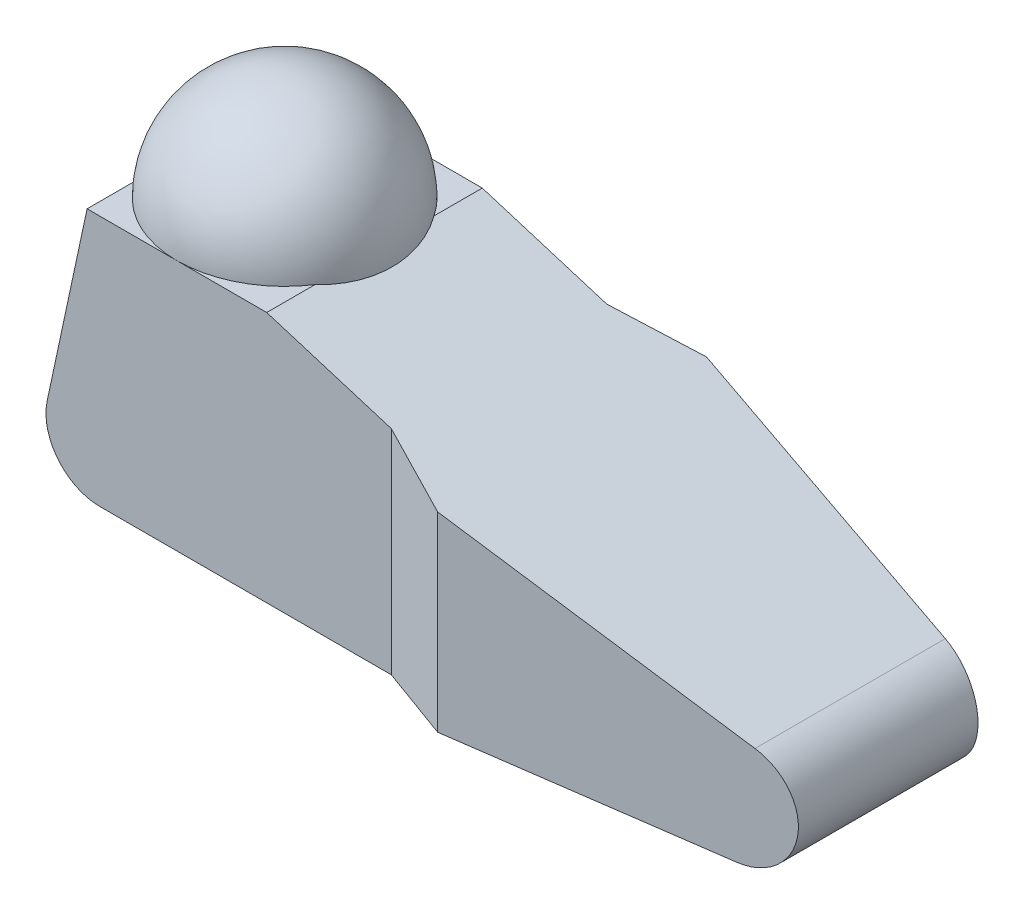
ISO-10303-21;
HEADER;
FILE_DESCRIPTION(('STEP AP214'),'2;1');
FILE_NAME('part.step','',(''),(''),'','','');
FILE_SCHEMA(('AUTOMOTIVE_DESIGN { 1 0 10303 214 1 1 1 1 }'));
ENDSEC;
DATA;
#1=APPLICATION_CONTEXT('core data for automotive mechanical design processes');
#2=APPLICATION_PROTOCOL_DEFINITION('international standard','automotive_design',2000,#1);
#3=PRODUCT_CONTEXT('',#1,'mechanical');
#4=PRODUCT('Part','Part','',(#3));
#5=PRODUCT_RELATED_PRODUCT_CATEGORY('part','',(#4));
#6=PRODUCT_DEFINITION_FORMATION('','',#4);
#7=PRODUCT_DEFINITION_CONTEXT('part definition',#1,'design');
#8=PRODUCT_DEFINITION('design','',#6,#7);
#9=PRODUCT_DEFINITION_SHAPE('','',#8);
#10=(LENGTH_UNIT() NAMED_UNIT(*) SI_UNIT(.MILLI.,.METRE.));
#11=(NAMED_UNIT(*) PLANE_ANGLE_UNIT() SI_UNIT($,.RADIAN.));
#12=(NAMED_UNIT(*) SI_UNIT($,.STERADIAN.) SOLID_ANGLE_UNIT());
#13=UNCERTAINTY_MEASURE_WITH_UNIT(LENGTH_MEASURE(1.E-05),#10,'distance_accuracy_value','');
#14=(GEOMETRIC_REPRESENTATION_CONTEXT(3) GLOBAL_UNCERTAINTY_ASSIGNED_CONTEXT((#13)) GLOBAL_UNIT_ASSIGNED_CONTEXT((#10,
#11,#12)) REPRESENTATION_CONTEXT('',''));
#15=CARTESIAN_POINT('',(0.,0.,0.));
#16=DIRECTION('',(0.,0.,1.));
#17=DIRECTION('',(1.,0.,0.));
#18=AXIS2_PLACEMENT_3D('',#15,#16,#17);
#19=CARTESIAN_POINT('',(31.75,88.9,47.498));
#20=DIRECTION('',(-0.293567286568064,-0.955938412376584,0.));
#21=DIRECTION('',(0.955938412376584,-0.293567286568064,0.));
#22=AXIS2_PLACEMENT_3D('',#19,#20,#21);
#23=PLANE('',#22);
#24=CARTESIAN_POINT('',(2.7362706178382,97.8100738056607,0.));
#25=DIRECTION('',(-0.293567286568064,-0.955938412376584,0.));
#26=DIRECTION('',(0.955938412376584,-0.293567286568064,0.));
#27=AXIS2_PLACEMENT_3D('',#24,#25,#26);
#28=CIRCLE('',#27,36.9422983568109);
#29=CARTESIAN_POINT('',(31.75,88.9,21.0605674187568));
#30=VERTEX_POINT('',#29);
#31=CARTESIAN_POINT('',(31.75,88.9,-21.0605674187568));
#32=VERTEX_POINT('',#31);
#33=EDGE_CURVE('E38',#30,#32,#28,.F.);
#34=ORIENTED_EDGE('',*,*,#33,.F.);
#35=DIRECTION('',(0.,0.,-1.));
#36=VECTOR('',#35,1.);
#37=CARTESIAN_POINT('',(31.75,88.9,47.498));
#38=LINE('',#37,#36);
#39=CARTESIAN_POINT('',(31.75,88.9,38.1));
#40=VERTEX_POINT('',#39);
#41=EDGE_CURVE('E196',#40,#30,#38,.T.);
#42=ORIENTED_EDGE('',*,*,#41,.F.);
#43=DIRECTION('',(-0.955938412376584,0.293567286568064,0.));
#44=VECTOR('',#43,1.);
#45=CARTESIAN_POINT('',(31.75,88.9,38.1));
#46=LINE('',#45,#44);
#47=CARTESIAN_POINT('',(75.7792072119656,75.3786949414186,38.1));
#48=VERTEX_POINT('',#47);
#49=EDGE_CURVE('E181',#48,#40,#46,.T.);
#50=ORIENTED_EDGE('',*,*,#49,.F.);
#51=DIRECTION('',(-0.90285077749815,0.277264151638239,-0.328610808993426));
#52=VECTOR('',#51,1.);
#53=CARTESIAN_POINT('',(39.2927567055439,86.5836304613134,24.8200180616355));
#54=LINE('',#53,#52);
#55=CARTESIAN_POINT('',(101.6,67.4491672880897,47.498));
#56=VERTEX_POINT('',#55);
#57=EDGE_CURVE('E177',#56,#48,#54,.T.);
#58=ORIENTED_EDGE('',*,*,#57,.F.);
#59=DIRECTION('',(-0.947382301327854,0.290939717394537,0.13349477882347));
#60=VECTOR('',#59,1.);
#61=CARTESIAN_POINT('',(32.9947867897229,88.5177277997373,57.1650982250845));
#62=LINE('',#61,#60);
#63=CARTESIAN_POINT('',(199.902456809122,37.260626755774,33.6462901768965));
#64=VERTEX_POINT('',#63);
#65=EDGE_CURVE('E173',#64,#56,#62,.T.);
#66=ORIENTED_EDGE('',*,*,#65,.F.);
#67=DIRECTION('',(0.,0.,-1.));
#68=VECTOR('',#67,1.);
#69=CARTESIAN_POINT('',(199.902456809122,37.260626755774,47.498));
#70=LINE('',#69,#68);
#71=CARTESIAN_POINT('',(199.902456809122,37.260626755774,-33.6462901768965));
#72=VERTEX_POINT('',#71);
#73=EDGE_CURVE('E198',#64,#72,#70,.T.);
#74=ORIENTED_EDGE('',*,*,#73,.T.);
#75=DIRECTION('',(0.947382301327854,-0.290939717394537,0.13349477882347));
#76=VECTOR('',#75,1.);
#77=CARTESIAN_POINT('',(45.0089870311779,84.8281844991383,-55.4721881910613));
#78=LINE('',#77,#76);
#79=CARTESIAN_POINT('',(101.6,67.4491672880897,-47.498));
#80=VERTEX_POINT('',#79);
#81=EDGE_CURVE('E168',#80,#72,#78,.T.);
#82=ORIENTED_EDGE('',*,*,#81,.F.);
#83=DIRECTION('',(0.90285077749815,-0.277264151638239,-0.328610808993426));
#84=VECTOR('',#83,1.);
#85=CARTESIAN_POINT('',(11.1087236342104,95.2389057449228,-14.5618689420958));
#86=LINE('',#85,#84);
#87=CARTESIAN_POINT('',(75.7792072119656,75.3786949414186,-38.1));
#88=VERTEX_POINT('',#87);
#89=EDGE_CURVE('E161',#88,#80,#86,.T.);
#90=ORIENTED_EDGE('',*,*,#89,.F.);
#91=DIRECTION('',(0.955938412376584,-0.293567286568064,0.));
#92=VECTOR('',#91,1.);
#93=CARTESIAN_POINT('',(31.75,88.9,-38.1));
#94=LINE('',#93,#92);
#95=CARTESIAN_POINT('',(31.75,88.9,-38.1));
#96=VERTEX_POINT('',#95);
#97=EDGE_CURVE('E189',#96,#88,#94,.T.);
#98=ORIENTED_EDGE('',*,*,#97,.F.);
#99=EDGE_CURVE('E121',#32,#96,#38,.T.);
#100=ORIENTED_EDGE('',*,*,#99,.F.);
#101=EDGE_LOOP('',(#34,#42,#50,#58,#66,#74,#82,#90,#98,#100));
#102=FACE_BOUND('',#101,.T.);
#103=ADVANCED_FACE('F16',(#102),#23,.F.);
#104=CARTESIAN_POINT('',(-31.75,88.9,47.498));
#105=DIRECTION('',(0.,-1.,0.));
#106=DIRECTION('',(1.,0.,0.));
#107=AXIS2_PLACEMENT_3D('',#104,#105,#106);
#108=PLANE('',#107);
#109=CARTESIAN_POINT('',(0.,88.9,0.));
#110=DIRECTION('',(0.,-1.,0.));
#111=DIRECTION('',(1.,0.,0.));
#112=AXIS2_PLACEMENT_3D('',#109,#110,#111);
#113=CIRCLE('',#112,38.1);
#114=CARTESIAN_POINT('',(0.,88.9,-38.1));
#115=VERTEX_POINT('',#114);
#116=EDGE_CURVE('E31',#32,#115,#113,.F.);
#117=ORIENTED_EDGE('',*,*,#116,.F.);
#118=ORIENTED_EDGE('',*,*,#99,.T.);
#119=DIRECTION('',(1.,0.,0.));
#120=VECTOR('',#119,1.);
#121=CARTESIAN_POINT('',(-31.75,88.9,-38.1));
#122=LINE('',#121,#120);
#123=EDGE_CURVE('E185',#115,#96,#122,.T.);
#124=ORIENTED_EDGE('',*,*,#123,.F.);
#125=EDGE_LOOP('',(#117,#118,#124));
#126=FACE_BOUND('',#125,.T.);
#127=ADVANCED_FACE('F215',(#126),#108,.F.);
#128=CARTESIAN_POINT('',(-31.75,88.9,-21.0605674187568));
#129=VERTEX_POINT('',#128);
#130=EDGE_CURVE('E131',#115,#129,#113,.F.);
#131=ORIENTED_EDGE('',*,*,#130,.F.);
#132=CARTESIAN_POINT('',(-31.75,88.9,-38.1));
#133=VERTEX_POINT('',#132);
#134=EDGE_CURVE('E186',#133,#115,#122,.T.);
#135=ORIENTED_EDGE('',*,*,#134,.F.);
#136=DIRECTION('',(0.,0.,-1.));
#137=VECTOR('',#136,1.);
#138=CARTESIAN_POINT('',(-31.75,88.9,47.498));
#139=LINE('',#138,#137);
#140=EDGE_CURVE('E122',#129,#133,#139,.T.);
#141=ORIENTED_EDGE('',*,*,#140,.F.);
#142=EDGE_LOOP('',(#131,#135,#141));
#143=FACE_BOUND('',#142,.T.);
#144=ADVANCED_FACE('F213',(#143),#108,.F.);
#145=CARTESIAN_POINT('',(-31.75,88.9,21.0605674187568));
#146=VERTEX_POINT('',#145);
#147=CARTESIAN_POINT('',(0.,88.9,38.1));
#148=VERTEX_POINT('',#147);
#149=EDGE_CURVE('E125',#146,#148,#113,.F.);
#150=ORIENTED_EDGE('',*,*,#149,.F.);
#151=CARTESIAN_POINT('',(-31.75,88.9,38.1));
#152=VERTEX_POINT('',#151);
#153=EDGE_CURVE('E113',#152,#146,#139,.T.);
#154=ORIENTED_EDGE('',*,*,#153,.F.);
#155=DIRECTION('',(-1.,0.,0.));
#156=VECTOR('',#155,1.);
#157=CARTESIAN_POINT('',(-31.75,88.9,38.1));
#158=LINE('',#157,#156);
#159=EDGE_CURVE('E127',#148,#152,#158,.T.);
#160=ORIENTED_EDGE('',*,*,#159,.F.);
#161=EDGE_LOOP('',(#150,#154,#160));
#162=FACE_BOUND('',#161,.T.);
#163=ADVANCED_FACE('F126',(#162),#108,.F.);
#164=EDGE_CURVE('E133',#148,#30,#113,.F.);
#165=ORIENTED_EDGE('',*,*,#164,.F.);
#166=EDGE_CURVE('E179',#40,#148,#158,.T.);
#167=ORIENTED_EDGE('',*,*,#166,.F.);
#168=ORIENTED_EDGE('',*,*,#41,.T.);
#169=EDGE_LOOP('',(#165,#167,#168));
#170=FACE_BOUND('',#169,.T.);
#171=ADVANCED_FACE('F222',(#170),#108,.F.);
#172=CARTESIAN_POINT('',(-31.75,88.9,47.498));
#173=DIRECTION('',(0.97780241407741,-0.209529088730873,0.));
#174=DIRECTION('',(0.209529088730873,0.97780241407741,0.));
#175=AXIS2_PLACEMENT_3D('',#172,#173,#174);
#176=PLANE('',#175);
#177=CARTESIAN_POINT('',(-30.3560975609756,95.4048780487804,0.));
#178=DIRECTION('',(0.97780241407741,-0.209529088730873,0.));
#179=DIRECTION('',(0.209529088730873,0.97780241407741,0.));
#180=AXIS2_PLACEMENT_3D('',#177,#178,#179);
#181=CIRCLE('',#180,22.086283128653);
#182=EDGE_CURVE('E11',#129,#146,#181,.F.);
#183=ORIENTED_EDGE('',*,*,#182,.F.);
#184=ORIENTED_EDGE('',*,*,#140,.T.);
#185=DIRECTION('',(0.209529088730873,0.97780241407741,0.));
#186=VECTOR('',#185,1.);
#187=CARTESIAN_POINT('',(-31.75,88.9,-38.1));
#188=LINE('',#187,#186);
#189=CARTESIAN_POINT('',(-45.8625294699307,23.0415291403232,-38.1));
#190=VERTEX_POINT('',#189);
#191=EDGE_CURVE('E24',#190,#133,#188,.T.);
#192=ORIENTED_EDGE('',*,*,#191,.F.);
#193=DIRECTION('',(0.,0.,-1.));
#194=VECTOR('',#193,1.);
#195=CARTESIAN_POINT('',(-45.8625294699307,23.0415291403232,47.498));
#196=LINE('',#195,#194);
#197=CARTESIAN_POINT('',(-45.8625294699307,23.0415291403234,38.1));
#198=VERTEX_POINT('',#197);
#199=EDGE_CURVE('E193',#198,#190,#196,.T.);
#200=ORIENTED_EDGE('',*,*,#199,.F.);
#201=DIRECTION('',(-0.209529088730873,-0.97780241407741,0.));
#202=VECTOR('',#201,1.);
#203=CARTESIAN_POINT('',(-31.75,88.9,38.1));
#204=LINE('',#203,#202);
#205=EDGE_CURVE('E118',#152,#198,#204,.T.);
#206=ORIENTED_EDGE('',*,*,#205,.F.);
#207=ORIENTED_EDGE('',*,*,#153,.T.);
#208=EDGE_LOOP('',(#183,#184,#192,#200,#206,#207));
#209=FACE_BOUND('',#208,.T.);
#210=ADVANCED_FACE('F115',(#209),#176,.F.);
#211=CARTESIAN_POINT('',(-27.2353934817561,19.05,47.498));
#212=DIRECTION('',(0.,0.,-1.));
#213=DIRECTION('',(-1.,0.,0.));
#214=AXIS2_PLACEMENT_3D('',#211,#212,#213);
#215=CYLINDRICAL_SURFACE('',#214,19.05);
#216=CARTESIAN_POINT('',(-27.2353934817561,19.05,-38.1));
#217=DIRECTION('',(0.,0.,-1.));
#218=DIRECTION('',(-1.,0.,0.));
#219=AXIS2_PLACEMENT_3D('',#216,#217,#218);
#220=CIRCLE('',#219,19.05);
#221=CARTESIAN_POINT('',(-27.2353934817559,0.,-38.1));
#222=VERTEX_POINT('',#221);
#223=EDGE_CURVE('E191',#222,#190,#220,.T.);
#224=ORIENTED_EDGE('',*,*,#223,.F.);
#225=DIRECTION('',(0.,0.,-1.));
#226=VECTOR('',#225,1.);
#227=CARTESIAN_POINT('',(-27.2353934817559,0.,47.498));
#228=LINE('',#227,#226);
#229=CARTESIAN_POINT('',(-27.2353934817559,0.,38.1));
#230=VERTEX_POINT('',#229);
#231=EDGE_CURVE('E204',#230,#222,#228,.T.);
#232=ORIENTED_EDGE('',*,*,#231,.F.);
#233=CARTESIAN_POINT('',(-27.2353934817561,19.05,38.1));
#234=DIRECTION('',(0.,0.,1.));
#235=DIRECTION('',(1.,0.,0.));
#236=AXIS2_PLACEMENT_3D('',#233,#234,#235);
#237=CIRCLE('',#236,19.05);
#238=EDGE_CURVE('E183',#198,#230,#237,.T.);
#239=ORIENTED_EDGE('',*,*,#238,.F.);
#240=ORIENTED_EDGE('',*,*,#199,.T.);
#241=EDGE_LOOP('',(#224,#232,#239,#240));
#242=FACE_BOUND('',#241,.T.);
#243=ADVANCED_FACE('F18',(#242),#215,.T.);
#244=CARTESIAN_POINT('',(-27.2353934817559,0.,47.498));
#245=DIRECTION('',(0.,1.,0.));
#246=DIRECTION('',(0.,0.,1.));
#247=AXIS2_PLACEMENT_3D('',#244,#245,#246);
#248=PLANE('',#247);
#249=DIRECTION('',(0.990217748068667,0.,0.139530682682403));
#250=VECTOR('',#249,1.);
#251=CARTESIAN_POINT('',(213.36,0.,-31.75));
#252=LINE('',#251,#250);
#253=CARTESIAN_POINT('',(101.6,0.,-47.498));
#254=VERTEX_POINT('',#253);
#255=CARTESIAN_POINT('',(194.31,0.,-34.4343181818182));
#256=VERTEX_POINT('',#255);
#257=EDGE_CURVE('E155',#254,#256,#252,.T.);
#258=ORIENTED_EDGE('',*,*,#257,.T.);
#259=DIRECTION('',(0.,0.,-1.));
#260=VECTOR('',#259,1.);
#261=CARTESIAN_POINT('',(194.31,0.,47.498));
#262=LINE('',#261,#260);
#263=CARTESIAN_POINT('',(194.31,0.,34.4343181818182));
#264=VERTEX_POINT('',#263);
#265=EDGE_CURVE('E201',#264,#256,#262,.T.);
#266=ORIENTED_EDGE('',*,*,#265,.F.);
#267=DIRECTION('',(-0.990217748068667,0.,0.139530682682403));
#268=VECTOR('',#267,1.);
#269=CARTESIAN_POINT('',(213.36,0.,31.75));
#270=LINE('',#269,#268);
#271=CARTESIAN_POINT('',(101.6,0.,47.498));
#272=VERTEX_POINT('',#271);
#273=EDGE_CURVE('E140',#264,#272,#270,.T.);
#274=ORIENTED_EDGE('',*,*,#273,.T.);
#275=DIRECTION('',(-0.939692620785908,0.,-0.34202014332567));
#276=VECTOR('',#275,1.);
#277=CARTESIAN_POINT('',(101.6,0.,47.498));
#278=LINE('',#277,#276);
#279=CARTESIAN_POINT('',(75.7792072119656,0.,38.1));
#280=VERTEX_POINT('',#279);
#281=EDGE_CURVE('E143',#272,#280,#278,.T.);
#282=ORIENTED_EDGE('',*,*,#281,.T.);
#283=DIRECTION('',(-1.,0.,0.));
#284=VECTOR('',#283,1.);
#285=CARTESIAN_POINT('',(75.7792072119656,0.,38.1));
#286=LINE('',#285,#284);
#287=EDGE_CURVE('E146',#280,#230,#286,.T.);
#288=ORIENTED_EDGE('',*,*,#287,.T.);
#289=ORIENTED_EDGE('',*,*,#231,.T.);
#290=DIRECTION('',(1.,0.,0.));
#291=VECTOR('',#290,1.);
#292=CARTESIAN_POINT('',(75.7792072119656,0.,-38.1));
#293=LINE('',#292,#291);
#294=CARTESIAN_POINT('',(75.7792072119656,0.,-38.1));
#295=VERTEX_POINT('',#294);
#296=EDGE_CURVE('E149',#222,#295,#293,.T.);
#297=ORIENTED_EDGE('',*,*,#296,.T.);
#298=DIRECTION('',(0.939692620785908,0.,-0.34202014332567));
#299=VECTOR('',#298,1.);
#300=CARTESIAN_POINT('',(101.6,0.,-47.498));
#301=LINE('',#300,#299);
#302=EDGE_CURVE('E152',#295,#254,#301,.T.);
#303=ORIENTED_EDGE('',*,*,#302,.T.);
#304=EDGE_LOOP('',(#258,#266,#274,#282,#288,#289,#297,#303));
#305=FACE_BOUND('',#304,.T.);
#306=ADVANCED_FACE('F232',(#305),#248,.F.);
#307=CARTESIAN_POINT('',(194.31,19.05,47.498));
#308=DIRECTION('',(0.,0.,-1.));
#309=DIRECTION('',(-1.,0.,0.));
#310=AXIS2_PLACEMENT_3D('',#307,#308,#309);
#311=CYLINDRICAL_SURFACE('',#310,19.05);
#312=ORIENTED_EDGE('',*,*,#73,.F.);
#313=CARTESIAN_POINT('',(194.31,19.05,34.4343181818182));
#314=DIRECTION('',(0.139530682682403,0.,0.990217748068667));
#315=DIRECTION('',(0.990217748068667,0.,-0.139530682682403));
#316=AXIS2_PLACEMENT_3D('',#313,#314,#315);
#317=ELLIPSE('',#316,19.238192849154,19.05);
#318=EDGE_CURVE('E175',#264,#64,#317,.T.);
#319=ORIENTED_EDGE('',*,*,#318,.F.);
#320=ORIENTED_EDGE('',*,*,#265,.T.);
#321=CARTESIAN_POINT('',(194.31,19.05,-34.4343181818182));
#322=DIRECTION('',(0.139530682682403,0.,-0.990217748068667));
#323=DIRECTION('',(-0.990217748068667,0.,-0.139530682682403));
#324=AXIS2_PLACEMENT_3D('',#321,#322,#323);
#325=ELLIPSE('',#324,19.238192849154,19.05);
#326=EDGE_CURVE('E171',#72,#256,#325,.T.);
#327=ORIENTED_EDGE('',*,*,#326,.F.);
#328=EDGE_LOOP('',(#312,#319,#320,#327));
#329=FACE_BOUND('',#328,.T.);
#330=ADVANCED_FACE('F229',(#329),#311,.T.);
#331=CARTESIAN_POINT('',(75.7792072119656,127.,38.1));
#332=DIRECTION('',(0.,0.,1.));
#333=DIRECTION('',(1.,0.,0.));
#334=AXIS2_PLACEMENT_3D('',#331,#332,#333);
#335=PLANE('',#334);
#336=ORIENTED_EDGE('',*,*,#238,.T.);
#337=ORIENTED_EDGE('',*,*,#287,.F.);
#338=DIRECTION('',(0.,-1.,0.));
#339=VECTOR('',#338,1.);
#340=CARTESIAN_POINT('',(75.7792072119656,127.,38.1));
#341=LINE('',#340,#339);
#342=EDGE_CURVE('E164',#48,#280,#341,.T.);
#343=ORIENTED_EDGE('',*,*,#342,.F.);
#344=ORIENTED_EDGE('',*,*,#49,.T.);
#345=ORIENTED_EDGE('',*,*,#166,.T.);
#346=ORIENTED_EDGE('',*,*,#159,.T.);
#347=ORIENTED_EDGE('',*,*,#205,.T.);
#348=EDGE_LOOP('',(#336,#337,#343,#344,#345,#346,#347));
#349=FACE_BOUND('',#348,.T.);
#350=ADVANCED_FACE('F231',(#349),#335,.T.);
#351=CARTESIAN_POINT('',(213.36,127.,31.75));
#352=DIRECTION('',(0.139530682682403,0.,0.990217748068667));
#353=DIRECTION('',(0.990217748068667,0.,-0.139530682682403));
#354=AXIS2_PLACEMENT_3D('',#351,#352,#353);
#355=PLANE('',#354);
#356=ORIENTED_EDGE('',*,*,#318,.T.);
#357=ORIENTED_EDGE('',*,*,#65,.T.);
#358=DIRECTION('',(0.,-1.,0.));
#359=VECTOR('',#358,1.);
#360=CARTESIAN_POINT('',(101.6,127.,47.498));
#361=LINE('',#360,#359);
#362=EDGE_CURVE('E158',#56,#272,#361,.T.);
#363=ORIENTED_EDGE('',*,*,#362,.T.);
#364=ORIENTED_EDGE('',*,*,#273,.F.);
#365=EDGE_LOOP('',(#356,#357,#363,#364));
#366=FACE_BOUND('',#365,.T.);
#367=ADVANCED_FACE('F249',(#366),#355,.T.);
#368=CARTESIAN_POINT('',(101.6,127.,47.498));
#369=DIRECTION('',(-0.34202014332567,0.,0.939692620785908));
#370=DIRECTION('',(0.939692620785908,0.,0.34202014332567));
#371=AXIS2_PLACEMENT_3D('',#368,#369,#370);
#372=PLANE('',#371);
#373=ORIENTED_EDGE('',*,*,#57,.T.);
#374=ORIENTED_EDGE('',*,*,#342,.T.);
#375=ORIENTED_EDGE('',*,*,#281,.F.);
#376=ORIENTED_EDGE('',*,*,#362,.F.);
#377=EDGE_LOOP('',(#373,#374,#375,#376));
#378=FACE_BOUND('',#377,.T.);
#379=ADVANCED_FACE('F256',(#378),#372,.T.);
#380=CARTESIAN_POINT('',(75.7792072119656,127.,-38.1));
#381=DIRECTION('',(0.,0.,-1.));
#382=DIRECTION('',(-1.,0.,0.));
#383=AXIS2_PLACEMENT_3D('',#380,#381,#382);
#384=PLANE('',#383);
#385=ORIENTED_EDGE('',*,*,#223,.T.);
#386=ORIENTED_EDGE('',*,*,#191,.T.);
#387=ORIENTED_EDGE('',*,*,#134,.T.);
#388=ORIENTED_EDGE('',*,*,#123,.T.);
#389=ORIENTED_EDGE('',*,*,#97,.T.);
#390=DIRECTION('',(0.,-1.,0.));
#391=VECTOR('',#390,1.);
#392=CARTESIAN_POINT('',(75.7792072119656,127.,-38.1));
#393=LINE('',#392,#391);
#394=EDGE_CURVE('E162',#88,#295,#393,.T.);
#395=ORIENTED_EDGE('',*,*,#394,.T.);
#396=ORIENTED_EDGE('',*,*,#296,.F.);
#397=EDGE_LOOP('',(#385,#386,#387,#388,#389,#395,#396));
#398=FACE_BOUND('',#397,.T.);
#399=ADVANCED_FACE('F210',(#398),#384,.T.);
#400=CARTESIAN_POINT('',(213.36,127.,-31.75));
#401=DIRECTION('',(0.139530682682403,0.,-0.990217748068667));
#402=DIRECTION('',(-0.990217748068667,0.,-0.139530682682403));
#403=AXIS2_PLACEMENT_3D('',#400,#401,#402);
#404=PLANE('',#403);
#405=ORIENTED_EDGE('',*,*,#326,.T.);
#406=ORIENTED_EDGE('',*,*,#257,.F.);
#407=DIRECTION('',(0.,-1.,0.));
#408=VECTOR('',#407,1.);
#409=CARTESIAN_POINT('',(101.6,127.,-47.498));
#410=LINE('',#409,#408);
#411=EDGE_CURVE('E159',#80,#254,#410,.T.);
#412=ORIENTED_EDGE('',*,*,#411,.F.);
#413=ORIENTED_EDGE('',*,*,#81,.T.);
#414=EDGE_LOOP('',(#405,#406,#412,#413));
#415=FACE_BOUND('',#414,.T.);
#416=ADVANCED_FACE('F268',(#415),#404,.T.);
#417=CARTESIAN_POINT('',(101.6,127.,-47.498));
#418=DIRECTION('',(-0.34202014332567,0.,-0.939692620785908));
#419=DIRECTION('',(-0.939692620785908,0.,0.34202014332567));
#420=AXIS2_PLACEMENT_3D('',#417,#418,#419);
#421=PLANE('',#420);
#422=ORIENTED_EDGE('',*,*,#89,.T.);
#423=ORIENTED_EDGE('',*,*,#411,.T.);
#424=ORIENTED_EDGE('',*,*,#302,.F.);
#425=ORIENTED_EDGE('',*,*,#394,.F.);
#426=EDGE_LOOP('',(#422,#423,#424,#425));
#427=FACE_BOUND('',#426,.T.);
#428=ADVANCED_FACE('F267',(#427),#421,.T.);
#429=CARTESIAN_POINT('',(0.,88.9,0.));
#430=DIRECTION('',(0.,0.,1.));
#431=DIRECTION('',(-1.,0.,0.));
#432=AXIS2_PLACEMENT_3D('',#429,#430,#431);
#433=SPHERICAL_SURFACE('',#432,38.1);
#434=ORIENTED_EDGE('',*,*,#149,.T.);
#435=ORIENTED_EDGE('',*,*,#164,.T.);
#436=ORIENTED_EDGE('',*,*,#33,.T.);
#437=ORIENTED_EDGE('',*,*,#116,.T.);
#438=ORIENTED_EDGE('',*,*,#130,.T.);
#439=ORIENTED_EDGE('',*,*,#182,.T.);
#440=EDGE_LOOP('',(#434,#435,#436,#437,#438,#439));
#441=FACE_BOUND('',#440,.T.);
#442=ADVANCED_FACE('F135',(#441),#433,.T.);
#443=CLOSED_SHELL('',(#103,#127,#144,#163,#171,#210,#243,#306,#330,#350,#367,#379,#399,#416,
#428,#442));
#444=MANIFOLD_SOLID_BREP('B1',#443);
#445=ADVANCED_BREP_SHAPE_REPRESENTATION('',(#18,#444),#14);
#446=SHAPE_DEFINITION_REPRESENTATION(#9,#445);
ENDSEC;
END-ISO-10303-21;
